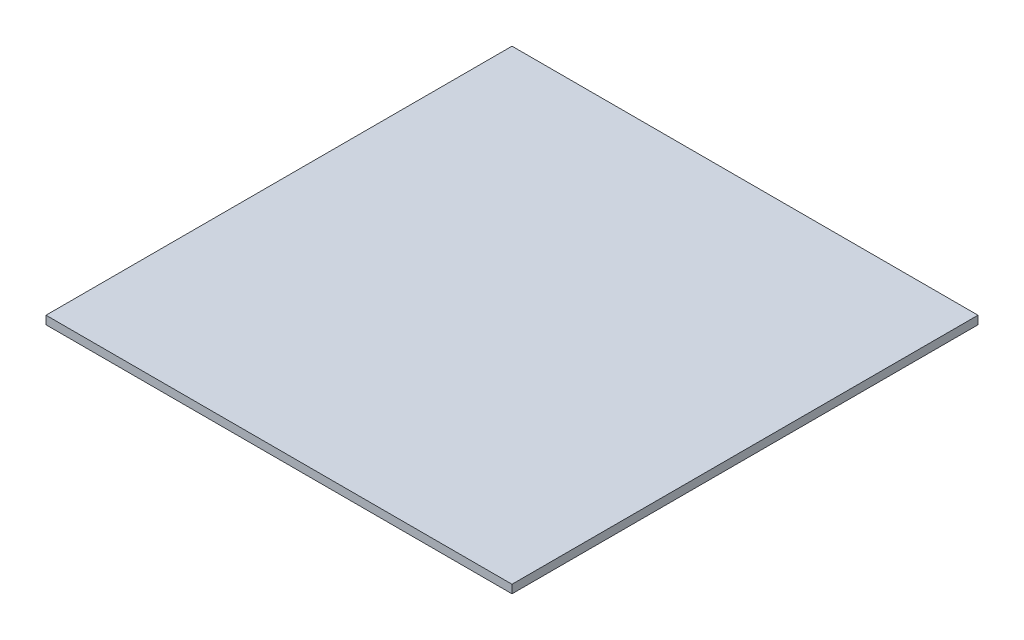
ISO-10303-21;
HEADER;
FILE_DESCRIPTION(('STEP AP214'),'2;1');
FILE_NAME('part.step','',(''),(''),'','','');
FILE_SCHEMA(('AUTOMOTIVE_DESIGN { 1 0 10303 214 1 1 1 1 }'));
ENDSEC;
DATA;
#1=APPLICATION_CONTEXT('core data for automotive mechanical design processes');
#2=APPLICATION_PROTOCOL_DEFINITION('international standard','automotive_design',2000,#1);
#3=PRODUCT_CONTEXT('',#1,'mechanical');
#4=PRODUCT('Part','Part','',(#3));
#5=PRODUCT_RELATED_PRODUCT_CATEGORY('part','',(#4));
#6=PRODUCT_DEFINITION_FORMATION('','',#4);
#7=PRODUCT_DEFINITION_CONTEXT('part definition',#1,'design');
#8=PRODUCT_DEFINITION('design','',#6,#7);
#9=PRODUCT_DEFINITION_SHAPE('','',#8);
#10=(LENGTH_UNIT() NAMED_UNIT(*) SI_UNIT(.MILLI.,.METRE.));
#11=(NAMED_UNIT(*) PLANE_ANGLE_UNIT() SI_UNIT($,.RADIAN.));
#12=(NAMED_UNIT(*) SI_UNIT($,.STERADIAN.) SOLID_ANGLE_UNIT());
#13=UNCERTAINTY_MEASURE_WITH_UNIT(LENGTH_MEASURE(1.E-05),#10,'distance_accuracy_value','');
#14=(GEOMETRIC_REPRESENTATION_CONTEXT(3) GLOBAL_UNCERTAINTY_ASSIGNED_CONTEXT((#13)) GLOBAL_UNIT_ASSIGNED_CONTEXT((#10,
#11,#12)) REPRESENTATION_CONTEXT('',''));
#15=CARTESIAN_POINT('',(0.,0.,0.));
#16=DIRECTION('',(0.,0.,1.));
#17=DIRECTION('',(1.,0.,0.));
#18=AXIS2_PLACEMENT_3D('',#15,#16,#17);
#19=CARTESIAN_POINT('',(280.,10.,280.));
#20=DIRECTION('',(-1.,0.,0.));
#21=DIRECTION('',(0.,0.,1.));
#22=AXIS2_PLACEMENT_3D('',#19,#20,#21);
#23=PLANE('',#22);
#24=DIRECTION('',(0.,0.,-1.));
#25=VECTOR('',#24,1.);
#26=CARTESIAN_POINT('',(280.,0.,280.));
#27=LINE('',#26,#25);
#28=CARTESIAN_POINT('',(280.,0.,280.));
#29=VERTEX_POINT('',#28);
#30=CARTESIAN_POINT('',(280.,0.,-280.));
#31=VERTEX_POINT('',#30);
#32=EDGE_CURVE('E97',#29,#31,#27,.T.);
#33=ORIENTED_EDGE('',*,*,#32,.T.);
#34=DIRECTION('',(0.,-1.,0.));
#35=VECTOR('',#34,1.);
#36=CARTESIAN_POINT('',(280.,10.,-280.));
#37=LINE('',#36,#35);
#38=CARTESIAN_POINT('',(280.,10.,-280.));
#39=VERTEX_POINT('',#38);
#40=EDGE_CURVE('E11',#39,#31,#37,.T.);
#41=ORIENTED_EDGE('',*,*,#40,.F.);
#42=DIRECTION('',(0.,0.,-1.));
#43=VECTOR('',#42,1.);
#44=CARTESIAN_POINT('',(280.,10.,280.));
#45=LINE('',#44,#43);
#46=CARTESIAN_POINT('',(280.,10.,280.));
#47=VERTEX_POINT('',#46);
#48=EDGE_CURVE('E85',#47,#39,#45,.T.);
#49=ORIENTED_EDGE('',*,*,#48,.F.);
#50=DIRECTION('',(0.,-1.,0.));
#51=VECTOR('',#50,1.);
#52=CARTESIAN_POINT('',(280.,10.,280.));
#53=LINE('',#52,#51);
#54=EDGE_CURVE('E93',#47,#29,#53,.T.);
#55=ORIENTED_EDGE('',*,*,#54,.T.);
#56=EDGE_LOOP('',(#33,#41,#49,#55));
#57=FACE_BOUND('',#56,.T.);
#58=ADVANCED_FACE('F34',(#57),#23,.F.);
#59=CARTESIAN_POINT('',(-280.,10.,-280.));
#60=DIRECTION('',(0.,0.,1.));
#61=DIRECTION('',(1.,0.,0.));
#62=AXIS2_PLACEMENT_3D('',#59,#60,#61);
#63=PLANE('',#62);
#64=DIRECTION('',(-1.,0.,0.));
#65=VECTOR('',#64,1.);
#66=CARTESIAN_POINT('',(-280.,0.,-280.));
#67=LINE('',#66,#65);
#68=CARTESIAN_POINT('',(-280.,0.,-280.));
#69=VERTEX_POINT('',#68);
#70=EDGE_CURVE('E89',#31,#69,#67,.T.);
#71=ORIENTED_EDGE('',*,*,#70,.T.);
#72=DIRECTION('',(0.,-1.,0.));
#73=VECTOR('',#72,1.);
#74=CARTESIAN_POINT('',(-280.,10.,-280.));
#75=LINE('',#74,#73);
#76=CARTESIAN_POINT('',(-280.,10.,-280.));
#77=VERTEX_POINT('',#76);
#78=EDGE_CURVE('E42',#77,#69,#75,.T.);
#79=ORIENTED_EDGE('',*,*,#78,.F.);
#80=DIRECTION('',(-1.,0.,0.));
#81=VECTOR('',#80,1.);
#82=CARTESIAN_POINT('',(-280.,10.,-280.));
#83=LINE('',#82,#81);
#84=EDGE_CURVE('E80',#39,#77,#83,.T.);
#85=ORIENTED_EDGE('',*,*,#84,.F.);
#86=ORIENTED_EDGE('',*,*,#40,.T.);
#87=EDGE_LOOP('',(#71,#79,#85,#86));
#88=FACE_BOUND('',#87,.T.);
#89=ADVANCED_FACE('F88',(#88),#63,.F.);
#90=CARTESIAN_POINT('',(-280.,10.,280.));
#91=DIRECTION('',(1.,0.,0.));
#92=DIRECTION('',(0.,0.,-1.));
#93=AXIS2_PLACEMENT_3D('',#90,#91,#92);
#94=PLANE('',#93);
#95=DIRECTION('',(0.,0.,1.));
#96=VECTOR('',#95,1.);
#97=CARTESIAN_POINT('',(-280.,0.,280.));
#98=LINE('',#97,#96);
#99=CARTESIAN_POINT('',(-280.,0.,280.));
#100=VERTEX_POINT('',#99);
#101=EDGE_CURVE('E67',#69,#100,#98,.T.);
#102=ORIENTED_EDGE('',*,*,#101,.T.);
#103=DIRECTION('',(0.,-1.,0.));
#104=VECTOR('',#103,1.);
#105=CARTESIAN_POINT('',(-280.,10.,280.));
#106=LINE('',#105,#104);
#107=CARTESIAN_POINT('',(-280.,10.,280.));
#108=VERTEX_POINT('',#107);
#109=EDGE_CURVE('E90',#108,#100,#106,.T.);
#110=ORIENTED_EDGE('',*,*,#109,.F.);
#111=DIRECTION('',(0.,0.,1.));
#112=VECTOR('',#111,1.);
#113=CARTESIAN_POINT('',(-280.,10.,280.));
#114=LINE('',#113,#112);
#115=EDGE_CURVE('E83',#77,#108,#114,.T.);
#116=ORIENTED_EDGE('',*,*,#115,.F.);
#117=ORIENTED_EDGE('',*,*,#78,.T.);
#118=EDGE_LOOP('',(#102,#110,#116,#117));
#119=FACE_BOUND('',#118,.T.);
#120=ADVANCED_FACE('F91',(#119),#94,.F.);
#121=CARTESIAN_POINT('',(-280.,10.,280.));
#122=DIRECTION('',(0.,0.,-1.));
#123=DIRECTION('',(-1.,0.,0.));
#124=AXIS2_PLACEMENT_3D('',#121,#122,#123);
#125=PLANE('',#124);
#126=DIRECTION('',(1.,0.,0.));
#127=VECTOR('',#126,1.);
#128=CARTESIAN_POINT('',(-280.,0.,280.));
#129=LINE('',#128,#127);
#130=EDGE_CURVE('E73',#100,#29,#129,.T.);
#131=ORIENTED_EDGE('',*,*,#130,.T.);
#132=ORIENTED_EDGE('',*,*,#54,.F.);
#133=DIRECTION('',(1.,0.,0.));
#134=VECTOR('',#133,1.);
#135=CARTESIAN_POINT('',(-280.,10.,280.));
#136=LINE('',#135,#134);
#137=EDGE_CURVE('E50',#108,#47,#136,.T.);
#138=ORIENTED_EDGE('',*,*,#137,.F.);
#139=ORIENTED_EDGE('',*,*,#109,.T.);
#140=EDGE_LOOP('',(#131,#132,#138,#139));
#141=FACE_BOUND('',#140,.T.);
#142=ADVANCED_FACE('F104',(#141),#125,.F.);
#143=CARTESIAN_POINT('',(0.,10.,0.));
#144=DIRECTION('',(0.,-1.,0.));
#145=DIRECTION('',(0.,0.,-1.));
#146=AXIS2_PLACEMENT_3D('',#143,#144,#145);
#147=PLANE('',#146);
#148=ORIENTED_EDGE('',*,*,#48,.T.);
#149=ORIENTED_EDGE('',*,*,#84,.T.);
#150=ORIENTED_EDGE('',*,*,#115,.T.);
#151=ORIENTED_EDGE('',*,*,#137,.T.);
#152=EDGE_LOOP('',(#148,#149,#150,#151));
#153=FACE_BOUND('',#152,.T.);
#154=ADVANCED_FACE('F81',(#153),#147,.F.);
#155=CARTESIAN_POINT('',(0.,0.,0.));
#156=DIRECTION('',(0.,-1.,0.));
#157=DIRECTION('',(0.,0.,-1.));
#158=AXIS2_PLACEMENT_3D('',#155,#156,#157);
#159=PLANE('',#158);
#160=ORIENTED_EDGE('',*,*,#32,.F.);
#161=ORIENTED_EDGE('',*,*,#130,.F.);
#162=ORIENTED_EDGE('',*,*,#101,.F.);
#163=ORIENTED_EDGE('',*,*,#70,.F.);
#164=EDGE_LOOP('',(#160,#161,#162,#163));
#165=FACE_BOUND('',#164,.T.);
#166=ADVANCED_FACE('F107',(#165),#159,.T.);
#167=CLOSED_SHELL('',(#58,#89,#120,#142,#154,#166));
#168=MANIFOLD_SOLID_BREP('B2',#167);
#169=ADVANCED_BREP_SHAPE_REPRESENTATION('',(#18,#168),#14);
#170=SHAPE_DEFINITION_REPRESENTATION(#9,#169);
ENDSEC;
END-ISO-10303-21;
